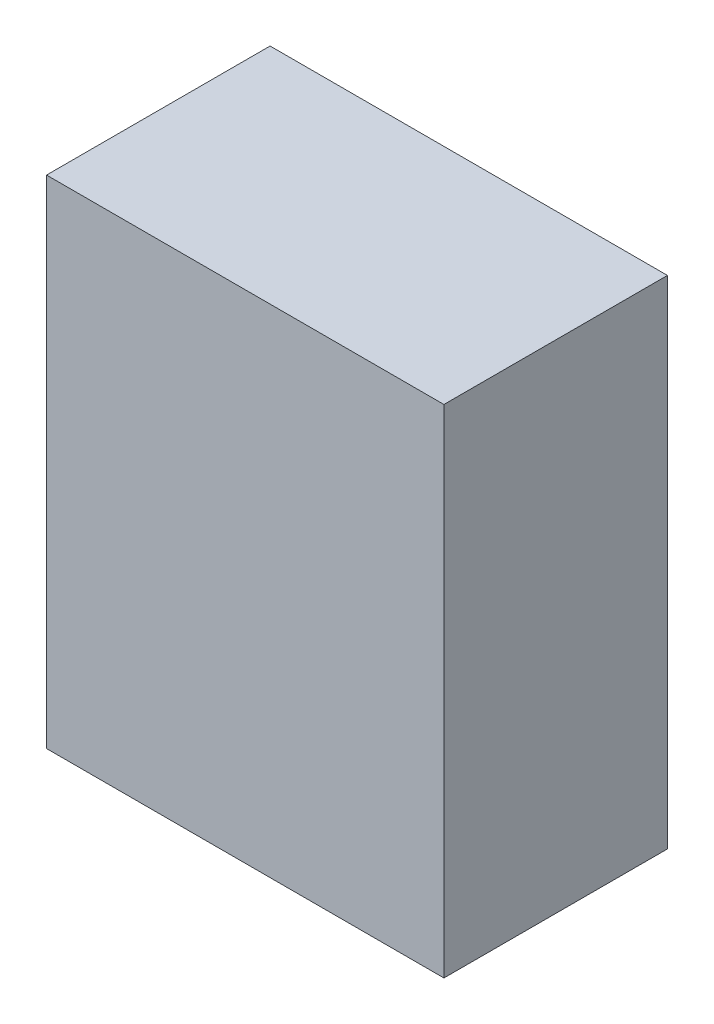
ISO-10303-21;
HEADER;
FILE_DESCRIPTION(('STEP AP214'),'2;1');
FILE_NAME('part.step','',(''),(''),'','','');
FILE_SCHEMA(('AUTOMOTIVE_DESIGN { 1 0 10303 214 1 1 1 1 }'));
ENDSEC;
DATA;
#1=APPLICATION_CONTEXT('core data for automotive mechanical design processes');
#2=APPLICATION_PROTOCOL_DEFINITION('international standard','automotive_design',2000,#1);
#3=PRODUCT_CONTEXT('',#1,'mechanical');
#4=PRODUCT('Part','Part','',(#3));
#5=PRODUCT_RELATED_PRODUCT_CATEGORY('part','',(#4));
#6=PRODUCT_DEFINITION_FORMATION('','',#4);
#7=PRODUCT_DEFINITION_CONTEXT('part definition',#1,'design');
#8=PRODUCT_DEFINITION('design','',#6,#7);
#9=PRODUCT_DEFINITION_SHAPE('','',#8);
#10=(LENGTH_UNIT() NAMED_UNIT(*) SI_UNIT(.MILLI.,.METRE.));
#11=(NAMED_UNIT(*) PLANE_ANGLE_UNIT() SI_UNIT($,.RADIAN.));
#12=(NAMED_UNIT(*) SI_UNIT($,.STERADIAN.) SOLID_ANGLE_UNIT());
#13=UNCERTAINTY_MEASURE_WITH_UNIT(LENGTH_MEASURE(1.E-05),#10,'distance_accuracy_value','');
#14=(GEOMETRIC_REPRESENTATION_CONTEXT(3) GLOBAL_UNCERTAINTY_ASSIGNED_CONTEXT((#13)) GLOBAL_UNIT_ASSIGNED_CONTEXT((#10,
#11,#12)) REPRESENTATION_CONTEXT('',''));
#15=CARTESIAN_POINT('',(0.,0.,0.));
#16=DIRECTION('',(0.,0.,1.));
#17=DIRECTION('',(1.,0.,0.));
#18=AXIS2_PLACEMENT_3D('',#15,#16,#17);
#19=CARTESIAN_POINT('',(-0.80000094,-1.00000054,0.));
#20=DIRECTION('',(-1.,0.,0.));
#21=DIRECTION('',(0.,1.,0.));
#22=AXIS2_PLACEMENT_3D('',#19,#20,#21);
#23=PLANE('',#22);
#24=DIRECTION('',(0.,0.,1.));
#25=VECTOR('',#24,1.);
#26=CARTESIAN_POINT('',(-0.80000094,-1.00000054,0.));
#27=LINE('',#26,#25);
#28=CARTESIAN_POINT('',(-0.80000094,-1.00000054,0.));
#29=VERTEX_POINT('',#28);
#30=CARTESIAN_POINT('',(-0.80000094,-1.00000054,0.90000074));
#31=VERTEX_POINT('',#30);
#32=EDGE_CURVE('E11',#29,#31,#27,.T.);
#33=ORIENTED_EDGE('',*,*,#32,.T.);
#34=DIRECTION('',(0.,1.,0.));
#35=VECTOR('',#34,1.);
#36=CARTESIAN_POINT('',(-0.80000094,-1.00000054,0.90000074));
#37=LINE('',#36,#35);
#38=CARTESIAN_POINT('',(-0.80000094,1.00000054,0.90000074));
#39=VERTEX_POINT('',#38);
#40=EDGE_CURVE('E24',#31,#39,#37,.T.);
#41=ORIENTED_EDGE('',*,*,#40,.T.);
#42=DIRECTION('',(0.,0.,1.));
#43=VECTOR('',#42,1.);
#44=CARTESIAN_POINT('',(-0.80000094,1.00000054,0.));
#45=LINE('',#44,#43);
#46=CARTESIAN_POINT('',(-0.80000094,1.00000054,0.));
#47=VERTEX_POINT('',#46);
#48=EDGE_CURVE('E85',#47,#39,#45,.T.);
#49=ORIENTED_EDGE('',*,*,#48,.F.);
#50=DIRECTION('',(0.,1.,0.));
#51=VECTOR('',#50,1.);
#52=CARTESIAN_POINT('',(-0.80000094,-1.00000054,0.));
#53=LINE('',#52,#51);
#54=EDGE_CURVE('E83',#29,#47,#53,.T.);
#55=ORIENTED_EDGE('',*,*,#54,.F.);
#56=EDGE_LOOP('',(#33,#41,#49,#55));
#57=FACE_BOUND('',#56,.T.);
#58=ADVANCED_FACE('F17',(#57),#23,.T.);
#59=CARTESIAN_POINT('',(-0.80000094,1.00000054,0.));
#60=DIRECTION('',(0.,1.,0.));
#61=DIRECTION('',(1.,0.,0.));
#62=AXIS2_PLACEMENT_3D('',#59,#60,#61);
#63=PLANE('',#62);
#64=ORIENTED_EDGE('',*,*,#48,.T.);
#65=DIRECTION('',(1.,0.,0.));
#66=VECTOR('',#65,1.);
#67=CARTESIAN_POINT('',(-0.80000094,1.00000054,0.90000074));
#68=LINE('',#67,#66);
#69=CARTESIAN_POINT('',(0.80000094,1.00000054,0.90000074));
#70=VERTEX_POINT('',#69);
#71=EDGE_CURVE('E81',#39,#70,#68,.T.);
#72=ORIENTED_EDGE('',*,*,#71,.T.);
#73=DIRECTION('',(0.,0.,1.));
#74=VECTOR('',#73,1.);
#75=CARTESIAN_POINT('',(0.80000094,1.00000054,0.));
#76=LINE('',#75,#74);
#77=CARTESIAN_POINT('',(0.80000094,1.00000054,0.));
#78=VERTEX_POINT('',#77);
#79=EDGE_CURVE('E79',#78,#70,#76,.T.);
#80=ORIENTED_EDGE('',*,*,#79,.F.);
#81=DIRECTION('',(1.,0.,0.));
#82=VECTOR('',#81,1.);
#83=CARTESIAN_POINT('',(-0.80000094,1.00000054,0.));
#84=LINE('',#83,#82);
#85=EDGE_CURVE('E70',#47,#78,#84,.T.);
#86=ORIENTED_EDGE('',*,*,#85,.F.);
#87=EDGE_LOOP('',(#64,#72,#80,#86));
#88=FACE_BOUND('',#87,.T.);
#89=ADVANCED_FACE('F90',(#88),#63,.T.);
#90=CARTESIAN_POINT('',(0.80000094,1.00000054,0.));
#91=DIRECTION('',(1.,0.,0.));
#92=DIRECTION('',(0.,-1.,0.));
#93=AXIS2_PLACEMENT_3D('',#90,#91,#92);
#94=PLANE('',#93);
#95=ORIENTED_EDGE('',*,*,#79,.T.);
#96=DIRECTION('',(0.,-1.,0.));
#97=VECTOR('',#96,1.);
#98=CARTESIAN_POINT('',(0.80000094,1.00000054,0.90000074));
#99=LINE('',#98,#97);
#100=CARTESIAN_POINT('',(0.80000094,-1.00000054,0.90000074));
#101=VERTEX_POINT('',#100);
#102=EDGE_CURVE('E60',#70,#101,#99,.T.);
#103=ORIENTED_EDGE('',*,*,#102,.T.);
#104=DIRECTION('',(0.,0.,1.));
#105=VECTOR('',#104,1.);
#106=CARTESIAN_POINT('',(0.80000094,-1.00000054,0.));
#107=LINE('',#106,#105);
#108=CARTESIAN_POINT('',(0.80000094,-1.00000054,0.));
#109=VERTEX_POINT('',#108);
#110=EDGE_CURVE('E54',#109,#101,#107,.T.);
#111=ORIENTED_EDGE('',*,*,#110,.F.);
#112=DIRECTION('',(0.,-1.,0.));
#113=VECTOR('',#112,1.);
#114=CARTESIAN_POINT('',(0.80000094,1.00000054,0.));
#115=LINE('',#114,#113);
#116=EDGE_CURVE('E58',#78,#109,#115,.T.);
#117=ORIENTED_EDGE('',*,*,#116,.F.);
#118=EDGE_LOOP('',(#95,#103,#111,#117));
#119=FACE_BOUND('',#118,.T.);
#120=ADVANCED_FACE('F57',(#119),#94,.T.);
#121=CARTESIAN_POINT('',(0.80000094,-1.00000054,0.));
#122=DIRECTION('',(0.,-1.,0.));
#123=DIRECTION('',(-1.,0.,0.));
#124=AXIS2_PLACEMENT_3D('',#121,#122,#123);
#125=PLANE('',#124);
#126=ORIENTED_EDGE('',*,*,#110,.T.);
#127=DIRECTION('',(-1.,0.,0.));
#128=VECTOR('',#127,1.);
#129=CARTESIAN_POINT('',(0.80000094,-1.00000054,0.90000074));
#130=LINE('',#129,#128);
#131=EDGE_CURVE('E71',#101,#31,#130,.T.);
#132=ORIENTED_EDGE('',*,*,#131,.T.);
#133=ORIENTED_EDGE('',*,*,#32,.F.);
#134=DIRECTION('',(-1.,0.,0.));
#135=VECTOR('',#134,1.);
#136=CARTESIAN_POINT('',(0.80000094,-1.00000054,0.));
#137=LINE('',#136,#135);
#138=EDGE_CURVE('E68',#109,#29,#137,.T.);
#139=ORIENTED_EDGE('',*,*,#138,.F.);
#140=EDGE_LOOP('',(#126,#132,#133,#139));
#141=FACE_BOUND('',#140,.T.);
#142=ADVANCED_FACE('F73',(#141),#125,.T.);
#143=CARTESIAN_POINT('',(0.,0.,0.));
#144=DIRECTION('',(0.,0.,-1.));
#145=DIRECTION('',(-1.,0.,0.));
#146=AXIS2_PLACEMENT_3D('',#143,#144,#145);
#147=PLANE('',#146);
#148=ORIENTED_EDGE('',*,*,#54,.T.);
#149=ORIENTED_EDGE('',*,*,#85,.T.);
#150=ORIENTED_EDGE('',*,*,#116,.T.);
#151=ORIENTED_EDGE('',*,*,#138,.T.);
#152=EDGE_LOOP('',(#148,#149,#150,#151));
#153=FACE_BOUND('',#152,.T.);
#154=ADVANCED_FACE('F67',(#153),#147,.T.);
#155=CARTESIAN_POINT('',(0.,0.,0.90000074));
#156=DIRECTION('',(0.,0.,-1.));
#157=DIRECTION('',(-1.,0.,0.));
#158=AXIS2_PLACEMENT_3D('',#155,#156,#157);
#159=PLANE('',#158);
#160=ORIENTED_EDGE('',*,*,#131,.F.);
#161=ORIENTED_EDGE('',*,*,#102,.F.);
#162=ORIENTED_EDGE('',*,*,#71,.F.);
#163=ORIENTED_EDGE('',*,*,#40,.F.);
#164=EDGE_LOOP('',(#160,#161,#162,#163));
#165=FACE_BOUND('',#164,.T.);
#166=ADVANCED_FACE('F91',(#165),#159,.F.);
#167=CLOSED_SHELL('',(#58,#89,#120,#142,#154,#166));
#168=MANIFOLD_SOLID_BREP('B1',#167);
#169=ADVANCED_BREP_SHAPE_REPRESENTATION('',(#18,#168),#14);
#170=SHAPE_DEFINITION_REPRESENTATION(#9,#169);
ENDSEC;
END-ISO-10303-21;
